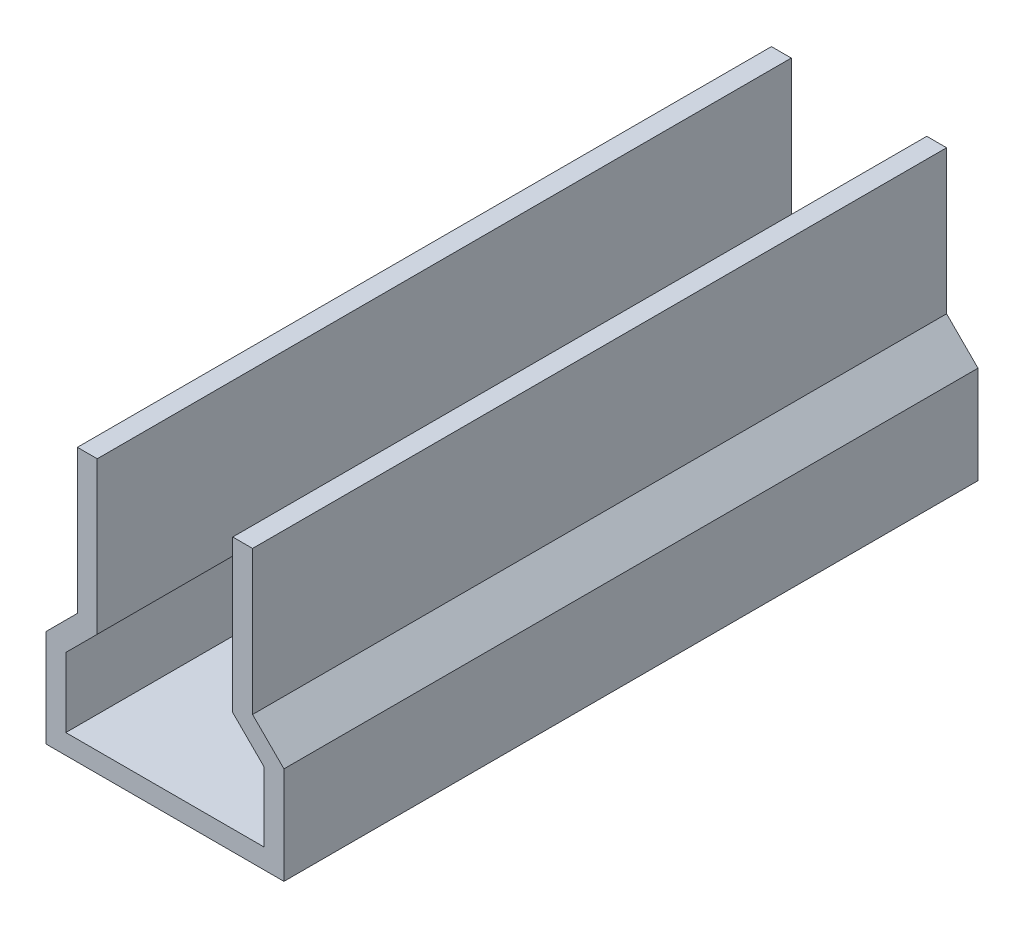
ISO-10303-21;
HEADER;
FILE_DESCRIPTION(('STEP AP214'),'2;1');
FILE_NAME('part.step','',(''),(''),'','','');
FILE_SCHEMA(('AUTOMOTIVE_DESIGN { 1 0 10303 214 1 1 1 1 }'));
ENDSEC;
DATA;
#1=APPLICATION_CONTEXT('core data for automotive mechanical design processes');
#2=APPLICATION_PROTOCOL_DEFINITION('international standard','automotive_design',2000,#1);
#3=PRODUCT_CONTEXT('',#1,'mechanical');
#4=PRODUCT('Part','Part','',(#3));
#5=PRODUCT_RELATED_PRODUCT_CATEGORY('part','',(#4));
#6=PRODUCT_DEFINITION_FORMATION('','',#4);
#7=PRODUCT_DEFINITION_CONTEXT('part definition',#1,'design');
#8=PRODUCT_DEFINITION('design','',#6,#7);
#9=PRODUCT_DEFINITION_SHAPE('','',#8);
#10=(LENGTH_UNIT() NAMED_UNIT(*) SI_UNIT(.MILLI.,.METRE.));
#11=(NAMED_UNIT(*) PLANE_ANGLE_UNIT() SI_UNIT($,.RADIAN.));
#12=(NAMED_UNIT(*) SI_UNIT($,.STERADIAN.) SOLID_ANGLE_UNIT());
#13=UNCERTAINTY_MEASURE_WITH_UNIT(LENGTH_MEASURE(1.E-05),#10,'distance_accuracy_value','');
#14=(GEOMETRIC_REPRESENTATION_CONTEXT(3) GLOBAL_UNCERTAINTY_ASSIGNED_CONTEXT((#13)) GLOBAL_UNIT_ASSIGNED_CONTEXT((#10,
#11,#12)) REPRESENTATION_CONTEXT('',''));
#15=CARTESIAN_POINT('',(0.,0.,0.));
#16=DIRECTION('',(0.,0.,1.));
#17=DIRECTION('',(1.,0.,0.));
#18=AXIS2_PLACEMENT_3D('',#15,#16,#17);
#19=CARTESIAN_POINT('',(13.25,38.25,105.));
#20=DIRECTION('',(0.,-1.,0.));
#21=DIRECTION('',(0.,0.,-1.));
#22=AXIS2_PLACEMENT_3D('',#19,#20,#21);
#23=PLANE('',#22);
#24=DIRECTION('',(-1.,0.,0.));
#25=VECTOR('',#24,1.);
#26=CARTESIAN_POINT('',(13.25,38.25,105.));
#27=LINE('',#26,#25);
#28=CARTESIAN_POINT('',(-10.25,38.25,105.));
#29=VERTEX_POINT('',#28);
#30=CARTESIAN_POINT('',(-13.25,38.25,105.));
#31=VERTEX_POINT('',#30);
#32=EDGE_CURVE('E261',#29,#31,#27,.T.);
#33=ORIENTED_EDGE('',*,*,#32,.F.);
#34=DIRECTION('',(0.,0.,1.));
#35=VECTOR('',#34,1.);
#36=CARTESIAN_POINT('',(-10.25,38.25,0.));
#37=LINE('',#36,#35);
#38=CARTESIAN_POINT('',(-10.25,38.25,0.));
#39=VERTEX_POINT('',#38);
#40=EDGE_CURVE('E180',#39,#29,#37,.T.);
#41=ORIENTED_EDGE('',*,*,#40,.F.);
#42=DIRECTION('',(-1.,0.,0.));
#43=VECTOR('',#42,1.);
#44=CARTESIAN_POINT('',(13.25,38.25,0.));
#45=LINE('',#44,#43);
#46=CARTESIAN_POINT('',(-13.25,38.25,0.));
#47=VERTEX_POINT('',#46);
#48=EDGE_CURVE('E188',#39,#47,#45,.T.);
#49=ORIENTED_EDGE('',*,*,#48,.T.);
#50=DIRECTION('',(0.,0.,-1.));
#51=VECTOR('',#50,1.);
#52=CARTESIAN_POINT('',(-13.25,38.25,105.));
#53=LINE('',#52,#51);
#54=EDGE_CURVE('E224',#31,#47,#53,.T.);
#55=ORIENTED_EDGE('',*,*,#54,.F.);
#56=EDGE_LOOP('',(#33,#41,#49,#55));
#57=FACE_BOUND('',#56,.T.);
#58=ADVANCED_FACE('F39',(#57),#23,.F.);
#59=CARTESIAN_POINT('',(0.,0.,105.));
#60=DIRECTION('',(0.,0.,1.));
#61=DIRECTION('',(1.,0.,0.));
#62=AXIS2_PLACEMENT_3D('',#59,#60,#61);
#63=PLANE('',#62);
#64=DIRECTION('',(0.,-1.,0.));
#65=VECTOR('',#64,1.);
#66=CARTESIAN_POINT('',(-10.25,35.25,105.));
#67=LINE('',#66,#65);
#68=CARTESIAN_POINT('',(-10.25,15.25,105.));
#69=VERTEX_POINT('',#68);
#70=EDGE_CURVE('E308',#29,#69,#67,.T.);
#71=ORIENTED_EDGE('',*,*,#70,.F.);
#72=ORIENTED_EDGE('',*,*,#32,.T.);
#73=DIRECTION('',(0.,-1.,0.));
#74=VECTOR('',#73,1.);
#75=CARTESIAN_POINT('',(-13.25,38.25,105.));
#76=LINE('',#75,#74);
#77=CARTESIAN_POINT('',(-13.25,16.4926406871193,105.));
#78=VERTEX_POINT('',#77);
#79=EDGE_CURVE('E255',#31,#78,#76,.T.);
#80=ORIENTED_EDGE('',*,*,#79,.T.);
#81=DIRECTION('',(-0.707106781186549,-0.707106781186546,0.));
#82=VECTOR('',#81,1.);
#83=CARTESIAN_POINT('',(-18.,11.7426406871193,105.));
#84=LINE('',#83,#82);
#85=CARTESIAN_POINT('',(-18.,11.7426406871193,105.));
#86=VERTEX_POINT('',#85);
#87=EDGE_CURVE('E252',#78,#86,#84,.T.);
#88=ORIENTED_EDGE('',*,*,#87,.T.);
#89=DIRECTION('',(0.,-1.,0.));
#90=VECTOR('',#89,1.);
#91=CARTESIAN_POINT('',(-18.,-3.,105.));
#92=LINE('',#91,#90);
#93=CARTESIAN_POINT('',(-18.,-3.,105.));
#94=VERTEX_POINT('',#93);
#95=EDGE_CURVE('E249',#86,#94,#92,.T.);
#96=ORIENTED_EDGE('',*,*,#95,.T.);
#97=DIRECTION('',(1.,0.,0.));
#98=VECTOR('',#97,1.);
#99=CARTESIAN_POINT('',(18.,-3.,105.));
#100=LINE('',#99,#98);
#101=CARTESIAN_POINT('',(18.,-3.,105.));
#102=VERTEX_POINT('',#101);
#103=EDGE_CURVE('E212',#94,#102,#100,.T.);
#104=ORIENTED_EDGE('',*,*,#103,.T.);
#105=DIRECTION('',(0.,1.,0.));
#106=VECTOR('',#105,1.);
#107=CARTESIAN_POINT('',(18.,-3.,105.));
#108=LINE('',#107,#106);
#109=CARTESIAN_POINT('',(18.,11.7426406871193,105.));
#110=VERTEX_POINT('',#109);
#111=EDGE_CURVE('E206',#102,#110,#108,.T.);
#112=ORIENTED_EDGE('',*,*,#111,.T.);
#113=DIRECTION('',(-0.707106781186549,0.707106781186546,0.));
#114=VECTOR('',#113,1.);
#115=CARTESIAN_POINT('',(18.,11.7426406871193,105.));
#116=LINE('',#115,#114);
#117=CARTESIAN_POINT('',(13.25,16.4926406871193,105.));
#118=VERTEX_POINT('',#117);
#119=EDGE_CURVE('E264',#110,#118,#116,.T.);
#120=ORIENTED_EDGE('',*,*,#119,.T.);
#121=DIRECTION('',(0.,1.,0.));
#122=VECTOR('',#121,1.);
#123=CARTESIAN_POINT('',(13.25,38.25,105.));
#124=LINE('',#123,#122);
#125=CARTESIAN_POINT('',(13.25,38.25,105.));
#126=VERTEX_POINT('',#125);
#127=EDGE_CURVE('E235',#118,#126,#124,.T.);
#128=ORIENTED_EDGE('',*,*,#127,.T.);
#129=CARTESIAN_POINT('',(10.25,38.25,105.));
#130=VERTEX_POINT('',#129);
#131=EDGE_CURVE('E258',#126,#130,#27,.T.);
#132=ORIENTED_EDGE('',*,*,#131,.T.);
#133=DIRECTION('',(0.,1.,0.));
#134=VECTOR('',#133,1.);
#135=CARTESIAN_POINT('',(10.25,35.25,105.));
#136=LINE('',#135,#134);
#137=CARTESIAN_POINT('',(10.25,15.25,105.));
#138=VERTEX_POINT('',#137);
#139=EDGE_CURVE('E175',#138,#130,#136,.T.);
#140=ORIENTED_EDGE('',*,*,#139,.F.);
#141=DIRECTION('',(-0.707106781186549,0.707106781186546,0.));
#142=VECTOR('',#141,1.);
#143=CARTESIAN_POINT('',(15.,10.5,105.));
#144=LINE('',#143,#142);
#145=CARTESIAN_POINT('',(15.,10.5,105.));
#146=VERTEX_POINT('',#145);
#147=EDGE_CURVE('E313',#146,#138,#144,.T.);
#148=ORIENTED_EDGE('',*,*,#147,.F.);
#149=DIRECTION('',(0.,1.,0.));
#150=VECTOR('',#149,1.);
#151=CARTESIAN_POINT('',(15.,0.,105.));
#152=LINE('',#151,#150);
#153=CARTESIAN_POINT('',(15.,0.,105.));
#154=VERTEX_POINT('',#153);
#155=EDGE_CURVE('E316',#154,#146,#152,.T.);
#156=ORIENTED_EDGE('',*,*,#155,.F.);
#157=DIRECTION('',(1.,0.,0.));
#158=VECTOR('',#157,1.);
#159=CARTESIAN_POINT('',(15.,0.,105.));
#160=LINE('',#159,#158);
#161=CARTESIAN_POINT('',(-15.,0.,105.));
#162=VERTEX_POINT('',#161);
#163=EDGE_CURVE('E319',#162,#154,#160,.T.);
#164=ORIENTED_EDGE('',*,*,#163,.F.);
#165=DIRECTION('',(0.,-1.,0.));
#166=VECTOR('',#165,1.);
#167=CARTESIAN_POINT('',(-15.,0.,105.));
#168=LINE('',#167,#166);
#169=CARTESIAN_POINT('',(-15.,10.5,105.));
#170=VERTEX_POINT('',#169);
#171=EDGE_CURVE('E291',#170,#162,#168,.T.);
#172=ORIENTED_EDGE('',*,*,#171,.F.);
#173=DIRECTION('',(-0.707106781186548,-0.707106781186546,0.));
#174=VECTOR('',#173,1.);
#175=CARTESIAN_POINT('',(-15.,10.5,105.));
#176=LINE('',#175,#174);
#177=EDGE_CURVE('E286',#69,#170,#176,.T.);
#178=ORIENTED_EDGE('',*,*,#177,.F.);
#179=EDGE_LOOP('',(#71,#72,#80,#88,#96,#104,#112,#120,#128,#132,#140,#148,#156,#164,#172,#178));
#180=FACE_BOUND('',#179,.T.);
#181=ADVANCED_FACE('F336',(#180),#63,.T.);
#182=CARTESIAN_POINT('',(0.,0.,0.));
#183=DIRECTION('',(0.,0.,1.));
#184=DIRECTION('',(1.,0.,0.));
#185=AXIS2_PLACEMENT_3D('',#182,#183,#184);
#186=PLANE('',#185);
#187=ORIENTED_EDGE('',*,*,#48,.F.);
#188=DIRECTION('',(0.,-1.,0.));
#189=VECTOR('',#188,1.);
#190=CARTESIAN_POINT('',(-10.25,35.25,0.));
#191=LINE('',#190,#189);
#192=CARTESIAN_POINT('',(-10.25,15.25,0.));
#193=VERTEX_POINT('',#192);
#194=EDGE_CURVE('E169',#39,#193,#191,.T.);
#195=ORIENTED_EDGE('',*,*,#194,.T.);
#196=DIRECTION('',(-0.707106781186548,-0.707106781186546,0.));
#197=VECTOR('',#196,1.);
#198=CARTESIAN_POINT('',(-15.,10.5,0.));
#199=LINE('',#198,#197);
#200=CARTESIAN_POINT('',(-15.,10.5,0.));
#201=VERTEX_POINT('',#200);
#202=EDGE_CURVE('E287',#193,#201,#199,.T.);
#203=ORIENTED_EDGE('',*,*,#202,.T.);
#204=DIRECTION('',(0.,-1.,0.));
#205=VECTOR('',#204,1.);
#206=CARTESIAN_POINT('',(-15.,0.,0.));
#207=LINE('',#206,#205);
#208=CARTESIAN_POINT('',(-15.,0.,0.));
#209=VERTEX_POINT('',#208);
#210=EDGE_CURVE('E63',#201,#209,#207,.T.);
#211=ORIENTED_EDGE('',*,*,#210,.T.);
#212=DIRECTION('',(1.,0.,0.));
#213=VECTOR('',#212,1.);
#214=CARTESIAN_POINT('',(15.,0.,0.));
#215=LINE('',#214,#213);
#216=CARTESIAN_POINT('',(15.,0.,0.));
#217=VERTEX_POINT('',#216);
#218=EDGE_CURVE('E300',#209,#217,#215,.T.);
#219=ORIENTED_EDGE('',*,*,#218,.T.);
#220=DIRECTION('',(0.,1.,0.));
#221=VECTOR('',#220,1.);
#222=CARTESIAN_POINT('',(15.,0.,0.));
#223=LINE('',#222,#221);
#224=CARTESIAN_POINT('',(15.,10.5,0.));
#225=VERTEX_POINT('',#224);
#226=EDGE_CURVE('E297',#217,#225,#223,.T.);
#227=ORIENTED_EDGE('',*,*,#226,.T.);
#228=DIRECTION('',(-0.707106781186549,0.707106781186546,0.));
#229=VECTOR('',#228,1.);
#230=CARTESIAN_POINT('',(15.,10.5,0.));
#231=LINE('',#230,#229);
#232=CARTESIAN_POINT('',(10.25,15.25,0.));
#233=VERTEX_POINT('',#232);
#234=EDGE_CURVE('E165',#225,#233,#231,.T.);
#235=ORIENTED_EDGE('',*,*,#234,.T.);
#236=DIRECTION('',(0.,1.,0.));
#237=VECTOR('',#236,1.);
#238=CARTESIAN_POINT('',(10.25,35.25,0.));
#239=LINE('',#238,#237);
#240=CARTESIAN_POINT('',(10.25,38.25,0.));
#241=VERTEX_POINT('',#240);
#242=EDGE_CURVE('E156',#233,#241,#239,.T.);
#243=ORIENTED_EDGE('',*,*,#242,.T.);
#244=CARTESIAN_POINT('',(13.25,38.25,0.));
#245=VERTEX_POINT('',#244);
#246=EDGE_CURVE('E162',#245,#241,#45,.T.);
#247=ORIENTED_EDGE('',*,*,#246,.F.);
#248=DIRECTION('',(0.,1.,0.));
#249=VECTOR('',#248,1.);
#250=CARTESIAN_POINT('',(13.25,38.25,0.));
#251=LINE('',#250,#249);
#252=CARTESIAN_POINT('',(13.25,16.4926406871193,0.));
#253=VERTEX_POINT('',#252);
#254=EDGE_CURVE('E194',#253,#245,#251,.T.);
#255=ORIENTED_EDGE('',*,*,#254,.F.);
#256=DIRECTION('',(-0.707106781186549,0.707106781186546,0.));
#257=VECTOR('',#256,1.);
#258=CARTESIAN_POINT('',(18.,11.7426406871193,0.));
#259=LINE('',#258,#257);
#260=CARTESIAN_POINT('',(18.,11.7426406871193,0.));
#261=VERTEX_POINT('',#260);
#262=EDGE_CURVE('E238',#261,#253,#259,.T.);
#263=ORIENTED_EDGE('',*,*,#262,.F.);
#264=DIRECTION('',(0.,1.,0.));
#265=VECTOR('',#264,1.);
#266=CARTESIAN_POINT('',(18.,-3.,0.));
#267=LINE('',#266,#265);
#268=CARTESIAN_POINT('',(18.,-3.,0.));
#269=VERTEX_POINT('',#268);
#270=EDGE_CURVE('E241',#269,#261,#267,.T.);
#271=ORIENTED_EDGE('',*,*,#270,.F.);
#272=DIRECTION('',(1.,0.,0.));
#273=VECTOR('',#272,1.);
#274=CARTESIAN_POINT('',(18.,-3.,0.));
#275=LINE('',#274,#273);
#276=CARTESIAN_POINT('',(-18.,-3.,0.));
#277=VERTEX_POINT('',#276);
#278=EDGE_CURVE('E203',#277,#269,#275,.T.);
#279=ORIENTED_EDGE('',*,*,#278,.F.);
#280=DIRECTION('',(0.,-1.,0.));
#281=VECTOR('',#280,1.);
#282=CARTESIAN_POINT('',(-18.,-3.,0.));
#283=LINE('',#282,#281);
#284=CARTESIAN_POINT('',(-18.,11.7426406871193,0.));
#285=VERTEX_POINT('',#284);
#286=EDGE_CURVE('E200',#285,#277,#283,.T.);
#287=ORIENTED_EDGE('',*,*,#286,.F.);
#288=DIRECTION('',(-0.707106781186549,-0.707106781186546,0.));
#289=VECTOR('',#288,1.);
#290=CARTESIAN_POINT('',(-18.,11.7426406871193,0.));
#291=LINE('',#290,#289);
#292=CARTESIAN_POINT('',(-13.25,16.4926406871193,0.));
#293=VERTEX_POINT('',#292);
#294=EDGE_CURVE('E192',#293,#285,#291,.T.);
#295=ORIENTED_EDGE('',*,*,#294,.F.);
#296=DIRECTION('',(0.,-1.,0.));
#297=VECTOR('',#296,1.);
#298=CARTESIAN_POINT('',(-13.25,38.25,0.));
#299=LINE('',#298,#297);
#300=EDGE_CURVE('E187',#47,#293,#299,.T.);
#301=ORIENTED_EDGE('',*,*,#300,.F.);
#302=EDGE_LOOP('',(#187,#195,#203,#211,#219,#227,#235,#243,#247,#255,#263,#271,#279,#287,#295,#301));
#303=FACE_BOUND('',#302,.T.);
#304=ADVANCED_FACE('F159',(#303),#186,.F.);
#305=CARTESIAN_POINT('',(18.,-3.,105.));
#306=DIRECTION('',(-1.,0.,0.));
#307=DIRECTION('',(0.,0.,1.));
#308=AXIS2_PLACEMENT_3D('',#305,#306,#307);
#309=PLANE('',#308);
#310=ORIENTED_EDGE('',*,*,#270,.T.);
#311=DIRECTION('',(0.,0.,-1.));
#312=VECTOR('',#311,1.);
#313=CARTESIAN_POINT('',(18.,11.7426406871193,105.));
#314=LINE('',#313,#312);
#315=EDGE_CURVE('E11',#110,#261,#314,.T.);
#316=ORIENTED_EDGE('',*,*,#315,.F.);
#317=ORIENTED_EDGE('',*,*,#111,.F.);
#318=DIRECTION('',(0.,0.,-1.));
#319=VECTOR('',#318,1.);
#320=CARTESIAN_POINT('',(18.,-3.,105.));
#321=LINE('',#320,#319);
#322=EDGE_CURVE('E207',#102,#269,#321,.T.);
#323=ORIENTED_EDGE('',*,*,#322,.T.);
#324=EDGE_LOOP('',(#310,#316,#317,#323));
#325=FACE_BOUND('',#324,.T.);
#326=ADVANCED_FACE('F41',(#325),#309,.F.);
#327=CARTESIAN_POINT('',(18.,11.7426406871193,105.));
#328=DIRECTION('',(-0.707106781186546,-0.707106781186549,0.));
#329=DIRECTION('',(0.707106781186549,-0.707106781186546,0.));
#330=AXIS2_PLACEMENT_3D('',#327,#328,#329);
#331=PLANE('',#330);
#332=ORIENTED_EDGE('',*,*,#262,.T.);
#333=DIRECTION('',(0.,0.,-1.));
#334=VECTOR('',#333,1.);
#335=CARTESIAN_POINT('',(13.25,16.4926406871193,105.));
#336=LINE('',#335,#334);
#337=EDGE_CURVE('E48',#118,#253,#336,.T.);
#338=ORIENTED_EDGE('',*,*,#337,.F.);
#339=ORIENTED_EDGE('',*,*,#119,.F.);
#340=ORIENTED_EDGE('',*,*,#315,.T.);
#341=EDGE_LOOP('',(#332,#338,#339,#340));
#342=FACE_BOUND('',#341,.T.);
#343=ADVANCED_FACE('F375',(#342),#331,.F.);
#344=CARTESIAN_POINT('',(13.25,38.25,105.));
#345=DIRECTION('',(-1.,0.,0.));
#346=DIRECTION('',(0.,-1.,0.));
#347=AXIS2_PLACEMENT_3D('',#344,#345,#346);
#348=PLANE('',#347);
#349=ORIENTED_EDGE('',*,*,#254,.T.);
#350=DIRECTION('',(0.,0.,-1.));
#351=VECTOR('',#350,1.);
#352=CARTESIAN_POINT('',(13.25,38.25,105.));
#353=LINE('',#352,#351);
#354=EDGE_CURVE('E185',#126,#245,#353,.T.);
#355=ORIENTED_EDGE('',*,*,#354,.F.);
#356=ORIENTED_EDGE('',*,*,#127,.F.);
#357=ORIENTED_EDGE('',*,*,#337,.T.);
#358=EDGE_LOOP('',(#349,#355,#356,#357));
#359=FACE_BOUND('',#358,.T.);
#360=ADVANCED_FACE('F234',(#359),#348,.F.);
#361=ORIENTED_EDGE('',*,*,#246,.T.);
#362=DIRECTION('',(0.,0.,1.));
#363=VECTOR('',#362,1.);
#364=CARTESIAN_POINT('',(10.25,38.25,0.));
#365=LINE('',#364,#363);
#366=EDGE_CURVE('E172',#241,#130,#365,.T.);
#367=ORIENTED_EDGE('',*,*,#366,.T.);
#368=ORIENTED_EDGE('',*,*,#131,.F.);
#369=ORIENTED_EDGE('',*,*,#354,.T.);
#370=EDGE_LOOP('',(#361,#367,#368,#369));
#371=FACE_BOUND('',#370,.T.);
#372=ADVANCED_FACE('F183',(#371),#23,.F.);
#373=CARTESIAN_POINT('',(-13.25,38.25,105.));
#374=DIRECTION('',(1.,0.,0.));
#375=DIRECTION('',(0.,1.,0.));
#376=AXIS2_PLACEMENT_3D('',#373,#374,#375);
#377=PLANE('',#376);
#378=ORIENTED_EDGE('',*,*,#300,.T.);
#379=DIRECTION('',(0.,0.,-1.));
#380=VECTOR('',#379,1.);
#381=CARTESIAN_POINT('',(-13.25,16.4926406871193,105.));
#382=LINE('',#381,#380);
#383=EDGE_CURVE('E220',#78,#293,#382,.T.);
#384=ORIENTED_EDGE('',*,*,#383,.F.);
#385=ORIENTED_EDGE('',*,*,#79,.F.);
#386=ORIENTED_EDGE('',*,*,#54,.T.);
#387=EDGE_LOOP('',(#378,#384,#385,#386));
#388=FACE_BOUND('',#387,.T.);
#389=ADVANCED_FACE('F357',(#388),#377,.F.);
#390=CARTESIAN_POINT('',(-18.,11.7426406871193,105.));
#391=DIRECTION('',(0.707106781186546,-0.707106781186549,0.));
#392=DIRECTION('',(0.707106781186549,0.707106781186546,0.));
#393=AXIS2_PLACEMENT_3D('',#390,#391,#392);
#394=PLANE('',#393);
#395=ORIENTED_EDGE('',*,*,#294,.T.);
#396=DIRECTION('',(0.,0.,-1.));
#397=VECTOR('',#396,1.);
#398=CARTESIAN_POINT('',(-18.,11.7426406871193,105.));
#399=LINE('',#398,#397);
#400=EDGE_CURVE('E216',#86,#285,#399,.T.);
#401=ORIENTED_EDGE('',*,*,#400,.F.);
#402=ORIENTED_EDGE('',*,*,#87,.F.);
#403=ORIENTED_EDGE('',*,*,#383,.T.);
#404=EDGE_LOOP('',(#395,#401,#402,#403));
#405=FACE_BOUND('',#404,.T.);
#406=ADVANCED_FACE('F361',(#405),#394,.F.);
#407=CARTESIAN_POINT('',(-18.,-3.,105.));
#408=DIRECTION('',(1.,0.,0.));
#409=DIRECTION('',(0.,1.,0.));
#410=AXIS2_PLACEMENT_3D('',#407,#408,#409);
#411=PLANE('',#410);
#412=ORIENTED_EDGE('',*,*,#286,.T.);
#413=DIRECTION('',(0.,0.,-1.));
#414=VECTOR('',#413,1.);
#415=CARTESIAN_POINT('',(-18.,-3.,105.));
#416=LINE('',#415,#414);
#417=EDGE_CURVE('E211',#94,#277,#416,.T.);
#418=ORIENTED_EDGE('',*,*,#417,.F.);
#419=ORIENTED_EDGE('',*,*,#95,.F.);
#420=ORIENTED_EDGE('',*,*,#400,.T.);
#421=EDGE_LOOP('',(#412,#418,#419,#420));
#422=FACE_BOUND('',#421,.T.);
#423=ADVANCED_FACE('F367',(#422),#411,.F.);
#424=CARTESIAN_POINT('',(18.,-3.,105.));
#425=DIRECTION('',(0.,1.,0.));
#426=DIRECTION('',(0.,0.,1.));
#427=AXIS2_PLACEMENT_3D('',#424,#425,#426);
#428=PLANE('',#427);
#429=ORIENTED_EDGE('',*,*,#278,.T.);
#430=ORIENTED_EDGE('',*,*,#322,.F.);
#431=ORIENTED_EDGE('',*,*,#103,.F.);
#432=ORIENTED_EDGE('',*,*,#417,.T.);
#433=EDGE_LOOP('',(#429,#430,#431,#432));
#434=FACE_BOUND('',#433,.T.);
#435=ADVANCED_FACE('F371',(#434),#428,.F.);
#436=CARTESIAN_POINT('',(-15.,0.,105.));
#437=DIRECTION('',(1.,0.,0.));
#438=DIRECTION('',(0.,0.,-1.));
#439=AXIS2_PLACEMENT_3D('',#436,#437,#438);
#440=PLANE('',#439);
#441=ORIENTED_EDGE('',*,*,#210,.F.);
#442=DIRECTION('',(0.,0.,-1.));
#443=VECTOR('',#442,1.);
#444=CARTESIAN_POINT('',(-15.,10.5,105.));
#445=LINE('',#444,#443);
#446=EDGE_CURVE('E283',#170,#201,#445,.T.);
#447=ORIENTED_EDGE('',*,*,#446,.F.);
#448=ORIENTED_EDGE('',*,*,#171,.T.);
#449=DIRECTION('',(0.,0.,-1.));
#450=VECTOR('',#449,1.);
#451=CARTESIAN_POINT('',(-15.,0.,105.));
#452=LINE('',#451,#450);
#453=EDGE_CURVE('E244',#162,#209,#452,.T.);
#454=ORIENTED_EDGE('',*,*,#453,.T.);
#455=EDGE_LOOP('',(#441,#447,#448,#454));
#456=FACE_BOUND('',#455,.T.);
#457=ADVANCED_FACE('F341',(#456),#440,.T.);
#458=CARTESIAN_POINT('',(15.,0.,105.));
#459=DIRECTION('',(0.,1.,0.));
#460=DIRECTION('',(0.,0.,1.));
#461=AXIS2_PLACEMENT_3D('',#458,#459,#460);
#462=PLANE('',#461);
#463=ORIENTED_EDGE('',*,*,#218,.F.);
#464=ORIENTED_EDGE('',*,*,#453,.F.);
#465=ORIENTED_EDGE('',*,*,#163,.T.);
#466=DIRECTION('',(0.,0.,-1.));
#467=VECTOR('',#466,1.);
#468=CARTESIAN_POINT('',(15.,0.,105.));
#469=LINE('',#468,#467);
#470=EDGE_CURVE('E272',#154,#217,#469,.T.);
#471=ORIENTED_EDGE('',*,*,#470,.T.);
#472=EDGE_LOOP('',(#463,#464,#465,#471));
#473=FACE_BOUND('',#472,.T.);
#474=ADVANCED_FACE('F344',(#473),#462,.T.);
#475=CARTESIAN_POINT('',(15.,0.,105.));
#476=DIRECTION('',(-1.,0.,0.));
#477=DIRECTION('',(0.,-1.,0.));
#478=AXIS2_PLACEMENT_3D('',#475,#476,#477);
#479=PLANE('',#478);
#480=ORIENTED_EDGE('',*,*,#226,.F.);
#481=ORIENTED_EDGE('',*,*,#470,.F.);
#482=ORIENTED_EDGE('',*,*,#155,.T.);
#483=DIRECTION('',(0.,0.,-1.));
#484=VECTOR('',#483,1.);
#485=CARTESIAN_POINT('',(15.,10.5,105.));
#486=LINE('',#485,#484);
#487=EDGE_CURVE('E275',#146,#225,#486,.T.);
#488=ORIENTED_EDGE('',*,*,#487,.T.);
#489=EDGE_LOOP('',(#480,#481,#482,#488));
#490=FACE_BOUND('',#489,.T.);
#491=ADVANCED_FACE('F351',(#490),#479,.T.);
#492=CARTESIAN_POINT('',(15.,10.5,105.));
#493=DIRECTION('',(-0.707106781186546,-0.707106781186549,0.));
#494=DIRECTION('',(0.707106781186549,-0.707106781186546,0.));
#495=AXIS2_PLACEMENT_3D('',#492,#493,#494);
#496=PLANE('',#495);
#497=ORIENTED_EDGE('',*,*,#234,.F.);
#498=ORIENTED_EDGE('',*,*,#487,.F.);
#499=ORIENTED_EDGE('',*,*,#147,.T.);
#500=DIRECTION('',(0.,0.,-1.));
#501=VECTOR('',#500,1.);
#502=CARTESIAN_POINT('',(10.25,15.25,105.));
#503=LINE('',#502,#501);
#504=EDGE_CURVE('E278',#138,#233,#503,.T.);
#505=ORIENTED_EDGE('',*,*,#504,.T.);
#506=EDGE_LOOP('',(#497,#498,#499,#505));
#507=FACE_BOUND('',#506,.T.);
#508=ADVANCED_FACE('F353',(#507),#496,.T.);
#509=CARTESIAN_POINT('',(10.25,35.25,105.));
#510=DIRECTION('',(-1.,0.,0.));
#511=DIRECTION('',(0.,-1.,0.));
#512=AXIS2_PLACEMENT_3D('',#509,#510,#511);
#513=PLANE('',#512);
#514=ORIENTED_EDGE('',*,*,#242,.F.);
#515=ORIENTED_EDGE('',*,*,#504,.F.);
#516=ORIENTED_EDGE('',*,*,#139,.T.);
#517=ORIENTED_EDGE('',*,*,#366,.F.);
#518=EDGE_LOOP('',(#514,#515,#516,#517));
#519=FACE_BOUND('',#518,.T.);
#520=ADVANCED_FACE('F173',(#519),#513,.T.);
#521=CARTESIAN_POINT('',(-10.25,35.25,105.));
#522=DIRECTION('',(1.,0.,0.));
#523=DIRECTION('',(0.,1.,0.));
#524=AXIS2_PLACEMENT_3D('',#521,#522,#523);
#525=PLANE('',#524);
#526=ORIENTED_EDGE('',*,*,#194,.F.);
#527=ORIENTED_EDGE('',*,*,#40,.T.);
#528=ORIENTED_EDGE('',*,*,#70,.T.);
#529=DIRECTION('',(0.,0.,-1.));
#530=VECTOR('',#529,1.);
#531=CARTESIAN_POINT('',(-10.25,15.25,105.));
#532=LINE('',#531,#530);
#533=EDGE_CURVE('E55',#69,#193,#532,.T.);
#534=ORIENTED_EDGE('',*,*,#533,.T.);
#535=EDGE_LOOP('',(#526,#527,#528,#534));
#536=FACE_BOUND('',#535,.T.);
#537=ADVANCED_FACE('F329',(#536),#525,.T.);
#538=CARTESIAN_POINT('',(-15.,10.5,105.));
#539=DIRECTION('',(0.707106781186546,-0.707106781186549,0.));
#540=DIRECTION('',(0.707106781186549,0.707106781186546,0.));
#541=AXIS2_PLACEMENT_3D('',#538,#539,#540);
#542=PLANE('',#541);
#543=ORIENTED_EDGE('',*,*,#202,.F.);
#544=ORIENTED_EDGE('',*,*,#533,.F.);
#545=ORIENTED_EDGE('',*,*,#177,.T.);
#546=ORIENTED_EDGE('',*,*,#446,.T.);
#547=EDGE_LOOP('',(#543,#544,#545,#546));
#548=FACE_BOUND('',#547,.T.);
#549=ADVANCED_FACE('F340',(#548),#542,.T.);
#550=CLOSED_SHELL('',(#58,#181,#304,#326,#343,#360,#372,#389,#406,#423,#435,#457,#474,#491,#508,
#520,#537,#549));
#551=MANIFOLD_SOLID_BREP('B2',#550);
#552=ADVANCED_BREP_SHAPE_REPRESENTATION('',(#18,#551),#14);
#553=SHAPE_DEFINITION_REPRESENTATION(#9,#552);
ENDSEC;
END-ISO-10303-21;
